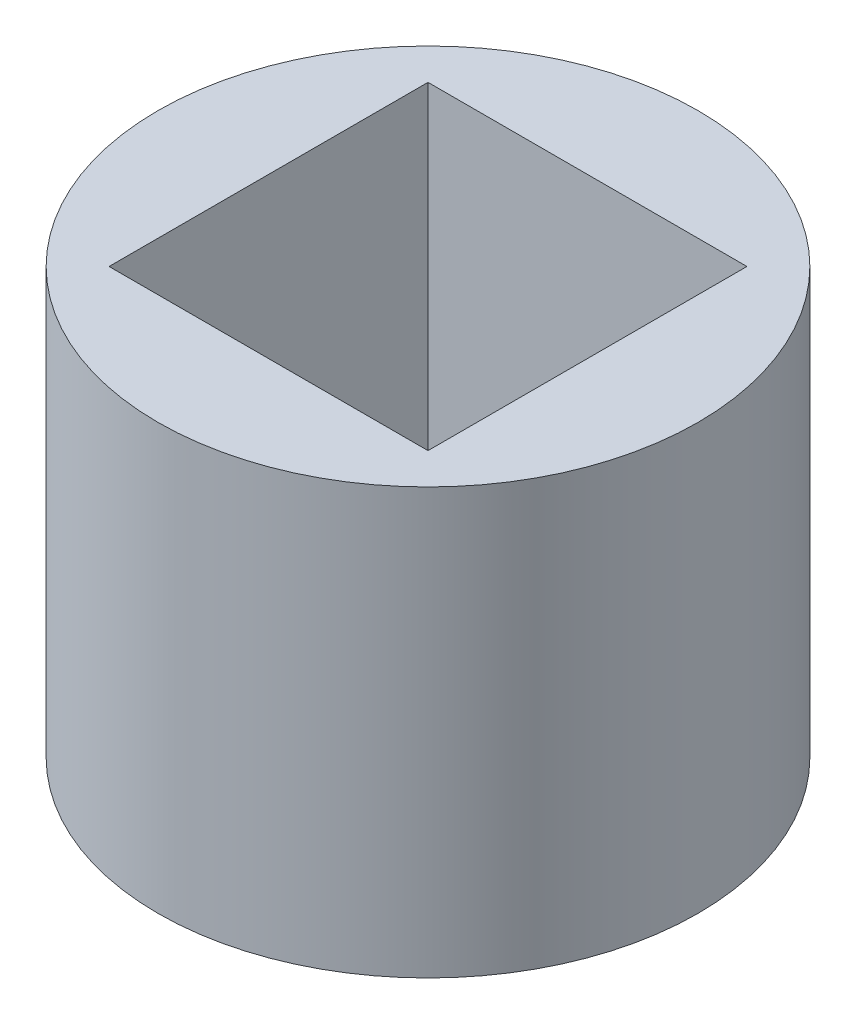
ISO-10303-21;
HEADER;
FILE_DESCRIPTION(('STEP AP214'),'2;1');
FILE_NAME('part.step','',(''),(''),'','','');
FILE_SCHEMA(('AUTOMOTIVE_DESIGN { 1 0 10303 214 1 1 1 1 }'));
ENDSEC;
DATA;
#1=APPLICATION_CONTEXT('core data for automotive mechanical design processes');
#2=APPLICATION_PROTOCOL_DEFINITION('international standard','automotive_design',2000,#1);
#3=PRODUCT_CONTEXT('',#1,'mechanical');
#4=PRODUCT('Part','Part','',(#3));
#5=PRODUCT_RELATED_PRODUCT_CATEGORY('part','',(#4));
#6=PRODUCT_DEFINITION_FORMATION('','',#4);
#7=PRODUCT_DEFINITION_CONTEXT('part definition',#1,'design');
#8=PRODUCT_DEFINITION('design','',#6,#7);
#9=PRODUCT_DEFINITION_SHAPE('','',#8);
#10=(LENGTH_UNIT() NAMED_UNIT(*) SI_UNIT(.MILLI.,.METRE.));
#11=(NAMED_UNIT(*) PLANE_ANGLE_UNIT() SI_UNIT($,.RADIAN.));
#12=(NAMED_UNIT(*) SI_UNIT($,.STERADIAN.) SOLID_ANGLE_UNIT());
#13=UNCERTAINTY_MEASURE_WITH_UNIT(LENGTH_MEASURE(1.E-05),#10,'distance_accuracy_value','');
#14=(GEOMETRIC_REPRESENTATION_CONTEXT(3) GLOBAL_UNCERTAINTY_ASSIGNED_CONTEXT((#13)) GLOBAL_UNIT_ASSIGNED_CONTEXT((#10,
#11,#12)) REPRESENTATION_CONTEXT('',''));
#15=CARTESIAN_POINT('',(0.,0.,0.));
#16=DIRECTION('',(0.,0.,1.));
#17=DIRECTION('',(1.,0.,0.));
#18=AXIS2_PLACEMENT_3D('',#15,#16,#17);
#19=CARTESIAN_POINT('',(0.,20.,0.));
#20=DIRECTION('',(0.,1.,0.));
#21=DIRECTION('',(0.,0.,1.));
#22=AXIS2_PLACEMENT_3D('',#19,#20,#21);
#23=PLANE('',#22);
#24=CARTESIAN_POINT('',(0.,20.,0.));
#25=DIRECTION('',(0.,1.,0.));
#26=DIRECTION('',(0.,0.,1.));
#27=AXIS2_PLACEMENT_3D('',#24,#25,#26);
#28=CIRCLE('',#27,12.7);
#29=CARTESIAN_POINT('',(0.,20.,12.7));
#30=VERTEX_POINT('',#29);
#31=EDGE_CURVE('E11',#30,#30,#28,.T.);
#32=ORIENTED_EDGE('',*,*,#31,.T.);
#33=EDGE_LOOP('',(#32));
#34=FACE_BOUND('',#33,.T.);
#35=DIRECTION('',(-1.,0.,0.));
#36=VECTOR('',#35,1.);
#37=CARTESIAN_POINT('',(-7.5,20.,-7.5));
#38=LINE('',#37,#36);
#39=CARTESIAN_POINT('',(7.5,20.,-7.5));
#40=VERTEX_POINT('',#39);
#41=CARTESIAN_POINT('',(-7.5,20.,-7.5));
#42=VERTEX_POINT('',#41);
#43=EDGE_CURVE('E92',#40,#42,#38,.T.);
#44=ORIENTED_EDGE('',*,*,#43,.F.);
#45=DIRECTION('',(0.,0.,-1.));
#46=VECTOR('',#45,1.);
#47=CARTESIAN_POINT('',(7.5,20.,7.5));
#48=LINE('',#47,#46);
#49=CARTESIAN_POINT('',(7.5,20.,7.5));
#50=VERTEX_POINT('',#49);
#51=EDGE_CURVE('E83',#50,#40,#48,.T.);
#52=ORIENTED_EDGE('',*,*,#51,.F.);
#53=DIRECTION('',(1.,0.,0.));
#54=VECTOR('',#53,1.);
#55=CARTESIAN_POINT('',(-7.5,20.,7.5));
#56=LINE('',#55,#54);
#57=CARTESIAN_POINT('',(-7.5,20.,7.5));
#58=VERTEX_POINT('',#57);
#59=EDGE_CURVE('E108',#58,#50,#56,.T.);
#60=ORIENTED_EDGE('',*,*,#59,.F.);
#61=DIRECTION('',(0.,0.,1.));
#62=VECTOR('',#61,1.);
#63=CARTESIAN_POINT('',(-7.5,20.,7.5));
#64=LINE('',#63,#62);
#65=EDGE_CURVE('E104',#42,#58,#64,.T.);
#66=ORIENTED_EDGE('',*,*,#65,.F.);
#67=EDGE_LOOP('',(#44,#52,#60,#66));
#68=FACE_BOUND('',#67,.T.);
#69=ADVANCED_FACE('F41',(#34,#68),#23,.T.);
#70=CARTESIAN_POINT('',(0.,0.,0.));
#71=DIRECTION('',(0.,1.,0.));
#72=DIRECTION('',(0.,0.,1.));
#73=AXIS2_PLACEMENT_3D('',#70,#71,#72);
#74=PLANE('',#73);
#75=CARTESIAN_POINT('',(0.,0.,0.));
#76=DIRECTION('',(0.,1.,0.));
#77=DIRECTION('',(0.,0.,1.));
#78=AXIS2_PLACEMENT_3D('',#75,#76,#77);
#79=CIRCLE('',#78,12.7);
#80=CARTESIAN_POINT('',(0.,0.,12.7));
#81=VERTEX_POINT('',#80);
#82=EDGE_CURVE('E45',#81,#81,#79,.T.);
#83=ORIENTED_EDGE('',*,*,#82,.F.);
#84=EDGE_LOOP('',(#83));
#85=FACE_BOUND('',#84,.T.);
#86=DIRECTION('',(0.,0.,-1.));
#87=VECTOR('',#86,1.);
#88=CARTESIAN_POINT('',(7.5,0.,7.5));
#89=LINE('',#88,#87);
#90=CARTESIAN_POINT('',(7.5,0.,7.5));
#91=VERTEX_POINT('',#90);
#92=CARTESIAN_POINT('',(7.5,0.,-7.5));
#93=VERTEX_POINT('',#92);
#94=EDGE_CURVE('E65',#91,#93,#89,.T.);
#95=ORIENTED_EDGE('',*,*,#94,.T.);
#96=DIRECTION('',(-1.,0.,0.));
#97=VECTOR('',#96,1.);
#98=CARTESIAN_POINT('',(-7.5,0.,-7.5));
#99=LINE('',#98,#97);
#100=CARTESIAN_POINT('',(-7.5,0.,-7.5));
#101=VERTEX_POINT('',#100);
#102=EDGE_CURVE('E99',#93,#101,#99,.T.);
#103=ORIENTED_EDGE('',*,*,#102,.T.);
#104=DIRECTION('',(0.,0.,1.));
#105=VECTOR('',#104,1.);
#106=CARTESIAN_POINT('',(-7.5,0.,7.5));
#107=LINE('',#106,#105);
#108=CARTESIAN_POINT('',(-7.5,0.,7.5));
#109=VERTEX_POINT('',#108);
#110=EDGE_CURVE('E117',#101,#109,#107,.T.);
#111=ORIENTED_EDGE('',*,*,#110,.T.);
#112=DIRECTION('',(1.,0.,0.));
#113=VECTOR('',#112,1.);
#114=CARTESIAN_POINT('',(-7.5,0.,7.5));
#115=LINE('',#114,#113);
#116=EDGE_CURVE('E93',#109,#91,#115,.T.);
#117=ORIENTED_EDGE('',*,*,#116,.T.);
#118=EDGE_LOOP('',(#95,#103,#111,#117));
#119=FACE_BOUND('',#118,.T.);
#120=ADVANCED_FACE('F133',(#85,#119),#74,.F.);
#121=CARTESIAN_POINT('',(0.,20.,0.));
#122=DIRECTION('',(0.,-1.,0.));
#123=DIRECTION('',(0.,0.,-1.));
#124=AXIS2_PLACEMENT_3D('',#121,#122,#123);
#125=CYLINDRICAL_SURFACE('',#124,12.7);
#126=ORIENTED_EDGE('',*,*,#31,.F.);
#127=EDGE_LOOP('',(#126));
#128=FACE_BOUND('',#127,.T.);
#129=ORIENTED_EDGE('',*,*,#82,.T.);
#130=EDGE_LOOP('',(#129));
#131=FACE_BOUND('',#130,.T.);
#132=ADVANCED_FACE('F43',(#128,#131),#125,.T.);
#133=CARTESIAN_POINT('',(7.5,20.,7.5));
#134=DIRECTION('',(-1.,0.,0.));
#135=DIRECTION('',(0.,0.,1.));
#136=AXIS2_PLACEMENT_3D('',#133,#134,#135);
#137=PLANE('',#136);
#138=ORIENTED_EDGE('',*,*,#94,.F.);
#139=DIRECTION('',(0.,-1.,0.));
#140=VECTOR('',#139,1.);
#141=CARTESIAN_POINT('',(7.5,20.,7.5));
#142=LINE('',#141,#140);
#143=EDGE_CURVE('E87',#50,#91,#142,.T.);
#144=ORIENTED_EDGE('',*,*,#143,.F.);
#145=ORIENTED_EDGE('',*,*,#51,.T.);
#146=DIRECTION('',(0.,-1.,0.));
#147=VECTOR('',#146,1.);
#148=CARTESIAN_POINT('',(7.5,20.,-7.5));
#149=LINE('',#148,#147);
#150=EDGE_CURVE('E86',#40,#93,#149,.T.);
#151=ORIENTED_EDGE('',*,*,#150,.T.);
#152=EDGE_LOOP('',(#138,#144,#145,#151));
#153=FACE_BOUND('',#152,.T.);
#154=ADVANCED_FACE('F85',(#153),#137,.T.);
#155=CARTESIAN_POINT('',(-7.5,20.,-7.5));
#156=DIRECTION('',(0.,0.,1.));
#157=DIRECTION('',(1.,0.,0.));
#158=AXIS2_PLACEMENT_3D('',#155,#156,#157);
#159=PLANE('',#158);
#160=ORIENTED_EDGE('',*,*,#102,.F.);
#161=ORIENTED_EDGE('',*,*,#150,.F.);
#162=ORIENTED_EDGE('',*,*,#43,.T.);
#163=DIRECTION('',(0.,-1.,0.));
#164=VECTOR('',#163,1.);
#165=CARTESIAN_POINT('',(-7.5,20.,-7.5));
#166=LINE('',#165,#164);
#167=EDGE_CURVE('E101',#42,#101,#166,.T.);
#168=ORIENTED_EDGE('',*,*,#167,.T.);
#169=EDGE_LOOP('',(#160,#161,#162,#168));
#170=FACE_BOUND('',#169,.T.);
#171=ADVANCED_FACE('F96',(#170),#159,.T.);
#172=CARTESIAN_POINT('',(-7.5,20.,7.5));
#173=DIRECTION('',(1.,0.,0.));
#174=DIRECTION('',(0.,0.,-1.));
#175=AXIS2_PLACEMENT_3D('',#172,#173,#174);
#176=PLANE('',#175);
#177=ORIENTED_EDGE('',*,*,#110,.F.);
#178=ORIENTED_EDGE('',*,*,#167,.F.);
#179=ORIENTED_EDGE('',*,*,#65,.T.);
#180=DIRECTION('',(0.,-1.,0.));
#181=VECTOR('',#180,1.);
#182=CARTESIAN_POINT('',(-7.5,20.,7.5));
#183=LINE('',#182,#181);
#184=EDGE_CURVE('E57',#58,#109,#183,.T.);
#185=ORIENTED_EDGE('',*,*,#184,.T.);
#186=EDGE_LOOP('',(#177,#178,#179,#185));
#187=FACE_BOUND('',#186,.T.);
#188=ADVANCED_FACE('F131',(#187),#176,.T.);
#189=CARTESIAN_POINT('',(-7.5,20.,7.5));
#190=DIRECTION('',(0.,0.,-1.));
#191=DIRECTION('',(-1.,0.,0.));
#192=AXIS2_PLACEMENT_3D('',#189,#190,#191);
#193=PLANE('',#192);
#194=ORIENTED_EDGE('',*,*,#116,.F.);
#195=ORIENTED_EDGE('',*,*,#184,.F.);
#196=ORIENTED_EDGE('',*,*,#59,.T.);
#197=ORIENTED_EDGE('',*,*,#143,.T.);
#198=EDGE_LOOP('',(#194,#195,#196,#197));
#199=FACE_BOUND('',#198,.T.);
#200=ADVANCED_FACE('F134',(#199),#193,.T.);
#201=CLOSED_SHELL('',(#69,#120,#132,#154,#171,#188,#200));
#202=MANIFOLD_SOLID_BREP('B2',#201);
#203=ADVANCED_BREP_SHAPE_REPRESENTATION('',(#18,#202),#14);
#204=SHAPE_DEFINITION_REPRESENTATION(#9,#203);
ENDSEC;
END-ISO-10303-21;
